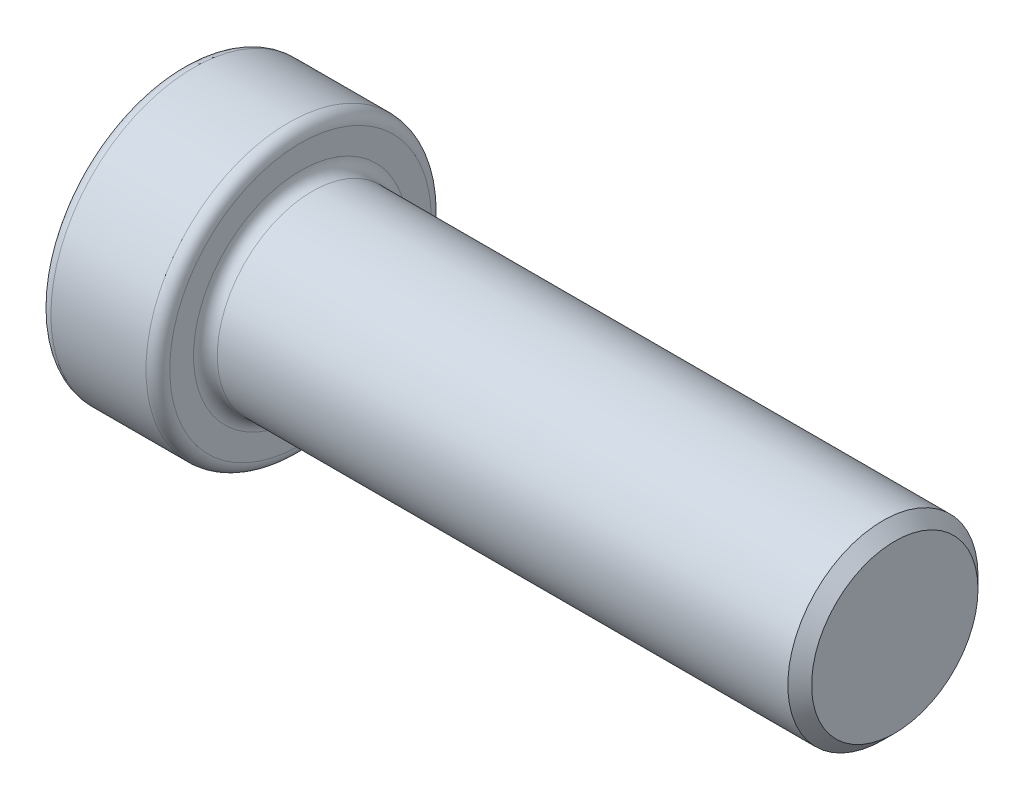
ISO-10303-21;
HEADER;
FILE_DESCRIPTION(('STEP AP214'),'2;1');
FILE_NAME('part.step','',(''),(''),'','','');
FILE_SCHEMA(('AUTOMOTIVE_DESIGN { 1 0 10303 214 1 1 1 1 }'));
ENDSEC;
DATA;
#1=APPLICATION_CONTEXT('core data for automotive mechanical design processes');
#2=APPLICATION_PROTOCOL_DEFINITION('international standard','automotive_design',2000,#1);
#3=PRODUCT_CONTEXT('',#1,'mechanical');
#4=PRODUCT('Part','Part','',(#3));
#5=PRODUCT_RELATED_PRODUCT_CATEGORY('part','',(#4));
#6=PRODUCT_DEFINITION_FORMATION('','',#4);
#7=PRODUCT_DEFINITION_CONTEXT('part definition',#1,'design');
#8=PRODUCT_DEFINITION('design','',#6,#7);
#9=PRODUCT_DEFINITION_SHAPE('','',#8);
#10=(LENGTH_UNIT() NAMED_UNIT(*) SI_UNIT(.MILLI.,.METRE.));
#11=(NAMED_UNIT(*) PLANE_ANGLE_UNIT() SI_UNIT($,.RADIAN.));
#12=(NAMED_UNIT(*) SI_UNIT($,.STERADIAN.) SOLID_ANGLE_UNIT());
#13=UNCERTAINTY_MEASURE_WITH_UNIT(LENGTH_MEASURE(1.E-05),#10,'distance_accuracy_value','');
#14=(GEOMETRIC_REPRESENTATION_CONTEXT(3) GLOBAL_UNCERTAINTY_ASSIGNED_CONTEXT((#13)) GLOBAL_UNIT_ASSIGNED_CONTEXT((#10,
#11,#12)) REPRESENTATION_CONTEXT('',''));
#15=CARTESIAN_POINT('',(0.,0.,0.));
#16=DIRECTION('',(0.,0.,1.));
#17=DIRECTION('',(1.,0.,0.));
#18=AXIS2_PLACEMENT_3D('',#15,#16,#17);
#19=CARTESIAN_POINT('',(0.,0.,0.));
#20=DIRECTION('',(1.,0.,0.));
#21=DIRECTION('',(0.,0.,-1.));
#22=AXIS2_PLACEMENT_3D('',#19,#20,#21);
#23=PLANE('',#22);
#24=CARTESIAN_POINT('',(0.,0.,0.));
#25=DIRECTION('',(1.,0.,0.));
#26=DIRECTION('',(0.,0.,-1.));
#27=AXIS2_PLACEMENT_3D('',#24,#25,#26);
#28=CIRCLE('',#27,3.50000000000001);
#29=CARTESIAN_POINT('',(0.,0.,-3.50000000000001));
#30=VERTEX_POINT('',#29);
#31=EDGE_CURVE('E85',#30,#30,#28,.T.);
#32=ORIENTED_EDGE('',*,*,#31,.T.);
#33=EDGE_LOOP('',(#32));
#34=FACE_BOUND('',#33,.T.);
#35=ADVANCED_FACE('F49',(#34),#23,.T.);
#36=CARTESIAN_POINT('',(0.,0.,0.));
#37=DIRECTION('',(1.,0.,0.));
#38=DIRECTION('',(0.,0.,-1.));
#39=AXIS2_PLACEMENT_3D('',#36,#37,#38);
#40=CYLINDRICAL_SURFACE('',#39,4.);
#41=CARTESIAN_POINT('',(-24.5,0.,0.));
#42=DIRECTION('',(1.,0.,0.));
#43=DIRECTION('',(0.,0.,-1.));
#44=AXIS2_PLACEMENT_3D('',#41,#42,#43);
#45=CIRCLE('',#44,4.);
#46=CARTESIAN_POINT('',(-24.5,0.,-4.));
#47=VERTEX_POINT('',#46);
#48=EDGE_CURVE('E77',#47,#47,#45,.T.);
#49=ORIENTED_EDGE('',*,*,#48,.T.);
#50=EDGE_LOOP('',(#49));
#51=FACE_BOUND('',#50,.T.);
#52=CARTESIAN_POINT('',(-0.499999999999992,0.,0.));
#53=DIRECTION('',(1.,0.,0.));
#54=DIRECTION('',(0.,0.,-1.));
#55=AXIS2_PLACEMENT_3D('',#52,#53,#54);
#56=CIRCLE('',#55,4.);
#57=CARTESIAN_POINT('',(-0.499999999999992,0.,-4.));
#58=VERTEX_POINT('',#57);
#59=EDGE_CURVE('E81',#58,#58,#56,.F.);
#60=ORIENTED_EDGE('',*,*,#59,.T.);
#61=EDGE_LOOP('',(#60));
#62=FACE_BOUND('',#61,.T.);
#63=ADVANCED_FACE('F119',(#51,#62),#40,.T.);
#64=CARTESIAN_POINT('',(-25.,4.,0.));
#65=DIRECTION('',(1.,0.,0.));
#66=DIRECTION('',(0.,0.,-1.));
#67=AXIS2_PLACEMENT_3D('',#64,#65,#66);
#68=PLANE('',#67);
#69=CARTESIAN_POINT('',(-25.,0.,0.));
#70=DIRECTION('',(1.,0.,0.));
#71=DIRECTION('',(0.,0.,-1.));
#72=AXIS2_PLACEMENT_3D('',#69,#70,#71);
#73=CIRCLE('',#72,4.5);
#74=CARTESIAN_POINT('',(-25.,0.,-4.5));
#75=VERTEX_POINT('',#74);
#76=EDGE_CURVE('E67',#75,#75,#73,.F.);
#77=ORIENTED_EDGE('',*,*,#76,.T.);
#78=EDGE_LOOP('',(#77));
#79=FACE_BOUND('',#78,.T.);
#80=CARTESIAN_POINT('',(-25.,0.,0.));
#81=DIRECTION('',(1.,0.,0.));
#82=DIRECTION('',(0.,0.,-1.));
#83=AXIS2_PLACEMENT_3D('',#80,#81,#82);
#84=CIRCLE('',#83,5.5);
#85=CARTESIAN_POINT('',(-25.,0.,-5.5));
#86=VERTEX_POINT('',#85);
#87=EDGE_CURVE('E73',#86,#86,#84,.T.);
#88=ORIENTED_EDGE('',*,*,#87,.T.);
#89=EDGE_LOOP('',(#88));
#90=FACE_BOUND('',#89,.T.);
#91=ADVANCED_FACE('F125',(#79,#90),#68,.T.);
#92=CARTESIAN_POINT('',(0.,0.,0.));
#93=DIRECTION('',(1.,0.,0.));
#94=DIRECTION('',(0.,0.,-1.));
#95=AXIS2_PLACEMENT_3D('',#92,#93,#94);
#96=CYLINDRICAL_SURFACE('',#95,6.);
#97=CARTESIAN_POINT('',(-25.5,0.,0.));
#98=DIRECTION('',(1.,0.,0.));
#99=DIRECTION('',(0.,0.,-1.));
#100=AXIS2_PLACEMENT_3D('',#97,#98,#99);
#101=CIRCLE('',#100,6.);
#102=CARTESIAN_POINT('',(-25.5,0.,-6.));
#103=VERTEX_POINT('',#102);
#104=EDGE_CURVE('E57',#103,#103,#101,.F.);
#105=ORIENTED_EDGE('',*,*,#104,.T.);
#106=EDGE_LOOP('',(#105));
#107=FACE_BOUND('',#106,.T.);
#108=CARTESIAN_POINT('',(-29.5,0.,0.));
#109=DIRECTION('',(-1.,0.,0.));
#110=DIRECTION('',(0.,0.,1.));
#111=AXIS2_PLACEMENT_3D('',#108,#109,#110);
#112=CIRCLE('',#111,6.);
#113=CARTESIAN_POINT('',(-29.5,0.,6.));
#114=VERTEX_POINT('',#113);
#115=EDGE_CURVE('E62',#114,#114,#112,.F.);
#116=ORIENTED_EDGE('',*,*,#115,.T.);
#117=EDGE_LOOP('',(#116));
#118=FACE_BOUND('',#117,.T.);
#119=ADVANCED_FACE('F147',(#107,#118),#96,.T.);
#120=CARTESIAN_POINT('',(-30.,6.,0.));
#121=DIRECTION('',(-1.,0.,0.));
#122=DIRECTION('',(0.,0.,1.));
#123=AXIS2_PLACEMENT_3D('',#120,#121,#122);
#124=PLANE('',#123);
#125=CARTESIAN_POINT('',(-30.,0.,0.));
#126=DIRECTION('',(-1.,0.,0.));
#127=DIRECTION('',(0.,0.,1.));
#128=AXIS2_PLACEMENT_3D('',#125,#126,#127);
#129=CIRCLE('',#128,5.5);
#130=CARTESIAN_POINT('',(-30.,0.,5.5));
#131=VERTEX_POINT('',#130);
#132=EDGE_CURVE('E12',#131,#131,#129,.T.);
#133=ORIENTED_EDGE('',*,*,#132,.T.);
#134=EDGE_LOOP('',(#133));
#135=FACE_BOUND('',#134,.T.);
#136=CARTESIAN_POINT('',(-30.,0.,0.));
#137=DIRECTION('',(-1.,0.,0.));
#138=DIRECTION('',(0.,0.,1.));
#139=AXIS2_PLACEMENT_3D('',#136,#137,#138);
#140=CIRCLE('',#139,3.);
#141=CARTESIAN_POINT('',(-30.,0.,3.));
#142=VERTEX_POINT('',#141);
#143=EDGE_CURVE('E93',#142,#142,#140,.F.);
#144=ORIENTED_EDGE('',*,*,#143,.T.);
#145=EDGE_LOOP('',(#144));
#146=FACE_BOUND('',#145,.T.);
#147=ADVANCED_FACE('F115',(#135,#146),#124,.T.);
#148=CARTESIAN_POINT('',(0.,0.,0.));
#149=DIRECTION('',(1.,0.,0.));
#150=DIRECTION('',(0.,0.,-1.));
#151=AXIS2_PLACEMENT_3D('',#148,#149,#150);
#152=CYLINDRICAL_SURFACE('',#151,2.5);
#153=CARTESIAN_POINT('',(-29.5,0.,0.));
#154=DIRECTION('',(-1.,0.,0.));
#155=DIRECTION('',(0.,0.,1.));
#156=AXIS2_PLACEMENT_3D('',#153,#154,#155);
#157=CIRCLE('',#156,2.5);
#158=CARTESIAN_POINT('',(-29.5,0.,2.5));
#159=VERTEX_POINT('',#158);
#160=EDGE_CURVE('E89',#159,#159,#157,.T.);
#161=ORIENTED_EDGE('',*,*,#160,.T.);
#162=EDGE_LOOP('',(#161));
#163=FACE_BOUND('',#162,.T.);
#164=CARTESIAN_POINT('',(-5.,0.,0.));
#165=DIRECTION('',(1.,0.,0.));
#166=DIRECTION('',(0.,0.,-1.));
#167=AXIS2_PLACEMENT_3D('',#164,#165,#166);
#168=CIRCLE('',#167,2.5);
#169=CARTESIAN_POINT('',(-5.,0.,-2.5));
#170=VERTEX_POINT('',#169);
#171=EDGE_CURVE('E97',#170,#170,#168,.T.);
#172=ORIENTED_EDGE('',*,*,#171,.T.);
#173=EDGE_LOOP('',(#172));
#174=FACE_BOUND('',#173,.T.);
#175=ADVANCED_FACE('F102',(#163,#174),#152,.F.);
#176=CARTESIAN_POINT('',(-5.,2.5,0.));
#177=DIRECTION('',(-1.,0.,0.));
#178=DIRECTION('',(0.,0.,1.));
#179=AXIS2_PLACEMENT_3D('',#176,#177,#178);
#180=PLANE('',#179);
#181=ORIENTED_EDGE('',*,*,#171,.F.);
#182=EDGE_LOOP('',(#181));
#183=FACE_BOUND('',#182,.T.);
#184=ADVANCED_FACE('F104',(#183),#180,.T.);
#185=CARTESIAN_POINT('',(-30.,0.,0.));
#186=DIRECTION('',(-1.,0.,0.));
#187=DIRECTION('',(0.,0.,1.));
#188=AXIS2_PLACEMENT_3D('',#185,#186,#187);
#189=CONICAL_SURFACE('',#188,3.,0.785398163397447);
#190=ORIENTED_EDGE('',*,*,#160,.F.);
#191=EDGE_LOOP('',(#190));
#192=FACE_BOUND('',#191,.T.);
#193=ORIENTED_EDGE('',*,*,#143,.F.);
#194=EDGE_LOOP('',(#193));
#195=FACE_BOUND('',#194,.T.);
#196=ADVANCED_FACE('F106',(#192,#195),#189,.F.);
#197=CARTESIAN_POINT('',(0.,0.,0.));
#198=DIRECTION('',(-1.,0.,0.));
#199=DIRECTION('',(0.,0.,1.));
#200=AXIS2_PLACEMENT_3D('',#197,#198,#199);
#201=CONICAL_SURFACE('',#200,3.50000000000001,0.785398163397448);
#202=ORIENTED_EDGE('',*,*,#59,.F.);
#203=EDGE_LOOP('',(#202));
#204=FACE_BOUND('',#203,.T.);
#205=ORIENTED_EDGE('',*,*,#31,.F.);
#206=EDGE_LOOP('',(#205));
#207=FACE_BOUND('',#206,.T.);
#208=ADVANCED_FACE('F112',(#204,#207),#201,.T.);
#209=CARTESIAN_POINT('',(-24.5,0.,0.));
#210=DIRECTION('',(1.,0.,0.));
#211=DIRECTION('',(0.,0.,-1.));
#212=AXIS2_PLACEMENT_3D('',#209,#210,#211);
#213=TOROIDAL_SURFACE('',#212,4.5,0.5);
#214=ORIENTED_EDGE('',*,*,#76,.F.);
#215=EDGE_LOOP('',(#214));
#216=FACE_BOUND('',#215,.T.);
#217=ORIENTED_EDGE('',*,*,#48,.F.);
#218=EDGE_LOOP('',(#217));
#219=FACE_BOUND('',#218,.T.);
#220=ADVANCED_FACE('F132',(#216,#219),#213,.F.);
#221=CARTESIAN_POINT('',(-25.5,0.,0.));
#222=DIRECTION('',(1.,0.,0.));
#223=DIRECTION('',(0.,0.,-1.));
#224=AXIS2_PLACEMENT_3D('',#221,#222,#223);
#225=TOROIDAL_SURFACE('',#224,5.5,0.5);
#226=ORIENTED_EDGE('',*,*,#104,.F.);
#227=EDGE_LOOP('',(#226));
#228=FACE_BOUND('',#227,.T.);
#229=ORIENTED_EDGE('',*,*,#87,.F.);
#230=EDGE_LOOP('',(#229));
#231=FACE_BOUND('',#230,.T.);
#232=ADVANCED_FACE('F135',(#228,#231),#225,.T.);
#233=CARTESIAN_POINT('',(-29.5,0.,0.));
#234=DIRECTION('',(-1.,0.,0.));
#235=DIRECTION('',(0.,0.,1.));
#236=AXIS2_PLACEMENT_3D('',#233,#234,#235);
#237=TOROIDAL_SURFACE('',#236,5.5,0.5);
#238=ORIENTED_EDGE('',*,*,#132,.F.);
#239=EDGE_LOOP('',(#238));
#240=FACE_BOUND('',#239,.T.);
#241=ORIENTED_EDGE('',*,*,#115,.F.);
#242=EDGE_LOOP('',(#241));
#243=FACE_BOUND('',#242,.T.);
#244=ADVANCED_FACE('F51',(#240,#243),#237,.T.);
#245=CLOSED_SHELL('',(#35,#63,#91,#119,#147,#175,#184,#196,#208,#220,#232,#244));
#246=MANIFOLD_SOLID_BREP('B2',#245);
#247=ADVANCED_BREP_SHAPE_REPRESENTATION('',(#18,#246),#14);
#248=SHAPE_DEFINITION_REPRESENTATION(#9,#247);
ENDSEC;
END-ISO-10303-21;
